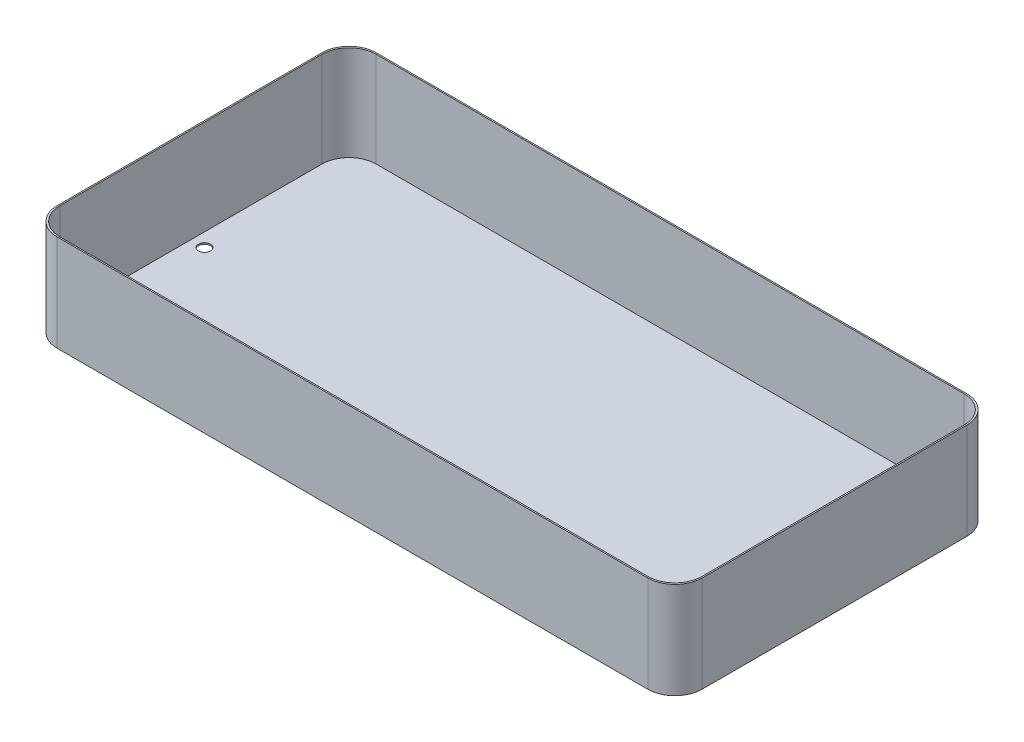
ISO-10303-21;
HEADER;
FILE_DESCRIPTION(('STEP AP214'),'2;1');
FILE_NAME('part.step','',(''),(''),'','','');
FILE_SCHEMA(('AUTOMOTIVE_DESIGN { 1 0 10303 214 1 1 1 1 }'));
ENDSEC;
DATA;
#1=APPLICATION_CONTEXT('core data for automotive mechanical design processes');
#2=APPLICATION_PROTOCOL_DEFINITION('international standard','automotive_design',2000,#1);
#3=PRODUCT_CONTEXT('',#1,'mechanical');
#4=PRODUCT('Part','Part','',(#3));
#5=PRODUCT_RELATED_PRODUCT_CATEGORY('part','',(#4));
#6=PRODUCT_DEFINITION_FORMATION('','',#4);
#7=PRODUCT_DEFINITION_CONTEXT('part definition',#1,'design');
#8=PRODUCT_DEFINITION('design','',#6,#7);
#9=PRODUCT_DEFINITION_SHAPE('','',#8);
#10=(LENGTH_UNIT() NAMED_UNIT(*) SI_UNIT(.MILLI.,.METRE.));
#11=(NAMED_UNIT(*) PLANE_ANGLE_UNIT() SI_UNIT($,.RADIAN.));
#12=(NAMED_UNIT(*) SI_UNIT($,.STERADIAN.) SOLID_ANGLE_UNIT());
#13=UNCERTAINTY_MEASURE_WITH_UNIT(LENGTH_MEASURE(1.E-05),#10,'distance_accuracy_value','');
#14=(GEOMETRIC_REPRESENTATION_CONTEXT(3) GLOBAL_UNCERTAINTY_ASSIGNED_CONTEXT((#13)) GLOBAL_UNIT_ASSIGNED_CONTEXT((#10,
#11,#12)) REPRESENTATION_CONTEXT('',''));
#15=CARTESIAN_POINT('',(0.,0.,0.));
#16=DIRECTION('',(0.,0.,1.));
#17=DIRECTION('',(1.,0.,0.));
#18=AXIS2_PLACEMENT_3D('',#15,#16,#17);
#19=CARTESIAN_POINT('',(0.,177.8,0.));
#20=DIRECTION('',(0.,-1.,0.));
#21=DIRECTION('',(0.,0.,-1.));
#22=AXIS2_PLACEMENT_3D('',#19,#20,#21);
#23=PLANE('',#22);
#24=DIRECTION('',(0.,0.,-1.));
#25=VECTOR('',#24,1.);
#26=CARTESIAN_POINT('',(603.25,177.8,298.45));
#27=LINE('',#26,#25);
#28=CARTESIAN_POINT('',(603.25,177.8,247.65));
#29=VERTEX_POINT('',#28);
#30=CARTESIAN_POINT('',(603.25,177.8,-247.65));
#31=VERTEX_POINT('',#30);
#32=EDGE_CURVE('E242',#29,#31,#27,.T.);
#33=ORIENTED_EDGE('',*,*,#32,.T.);
#34=CARTESIAN_POINT('',(552.45,177.8,-247.65));
#35=DIRECTION('',(0.,-1.,0.));
#36=DIRECTION('',(0.,0.,-1.));
#37=AXIS2_PLACEMENT_3D('',#34,#35,#36);
#38=CIRCLE('',#37,50.8);
#39=CARTESIAN_POINT('',(552.45,177.8,-298.45));
#40=VERTEX_POINT('',#39);
#41=EDGE_CURVE('E11',#31,#40,#38,.F.);
#42=ORIENTED_EDGE('',*,*,#41,.T.);
#43=DIRECTION('',(-1.,0.,0.));
#44=VECTOR('',#43,1.);
#45=CARTESIAN_POINT('',(-603.25,177.8,-298.45));
#46=LINE('',#45,#44);
#47=CARTESIAN_POINT('',(-552.45,177.8,-298.45));
#48=VERTEX_POINT('',#47);
#49=EDGE_CURVE('E253',#40,#48,#46,.T.);
#50=ORIENTED_EDGE('',*,*,#49,.T.);
#51=CARTESIAN_POINT('',(-552.45,177.8,-247.65));
#52=DIRECTION('',(0.,-1.,0.));
#53=DIRECTION('',(0.,0.,-1.));
#54=AXIS2_PLACEMENT_3D('',#51,#52,#53);
#55=CIRCLE('',#54,50.8);
#56=CARTESIAN_POINT('',(-603.25,177.8,-247.65));
#57=VERTEX_POINT('',#56);
#58=EDGE_CURVE('E58',#48,#57,#55,.F.);
#59=ORIENTED_EDGE('',*,*,#58,.T.);
#60=DIRECTION('',(0.,0.,1.));
#61=VECTOR('',#60,1.);
#62=CARTESIAN_POINT('',(-603.25,177.8,298.45));
#63=LINE('',#62,#61);
#64=CARTESIAN_POINT('',(-603.25,177.8,247.65));
#65=VERTEX_POINT('',#64);
#66=EDGE_CURVE('E181',#57,#65,#63,.T.);
#67=ORIENTED_EDGE('',*,*,#66,.T.);
#68=CARTESIAN_POINT('',(-552.45,177.8,247.65));
#69=DIRECTION('',(0.,-1.,0.));
#70=DIRECTION('',(0.,0.,-1.));
#71=AXIS2_PLACEMENT_3D('',#68,#69,#70);
#72=CIRCLE('',#71,50.8);
#73=CARTESIAN_POINT('',(-552.45,177.8,298.45));
#74=VERTEX_POINT('',#73);
#75=EDGE_CURVE('E237',#65,#74,#72,.F.);
#76=ORIENTED_EDGE('',*,*,#75,.T.);
#77=DIRECTION('',(1.,0.,0.));
#78=VECTOR('',#77,1.);
#79=CARTESIAN_POINT('',(-603.25,177.8,298.45));
#80=LINE('',#79,#78);
#81=CARTESIAN_POINT('',(552.45,177.8,298.45));
#82=VERTEX_POINT('',#81);
#83=EDGE_CURVE('E176',#74,#82,#80,.T.);
#84=ORIENTED_EDGE('',*,*,#83,.T.);
#85=CARTESIAN_POINT('',(552.45,177.8,247.65));
#86=DIRECTION('',(0.,-1.,0.));
#87=DIRECTION('',(0.,0.,-1.));
#88=AXIS2_PLACEMENT_3D('',#85,#86,#87);
#89=CIRCLE('',#88,50.8);
#90=EDGE_CURVE('E44',#82,#29,#89,.F.);
#91=ORIENTED_EDGE('',*,*,#90,.T.);
#92=EDGE_LOOP('',(#33,#42,#50,#59,#67,#76,#84,#91));
#93=FACE_BOUND('',#92,.T.);
#94=DIRECTION('',(0.,0.,-1.));
#95=VECTOR('',#94,1.);
#96=CARTESIAN_POINT('',(600.71,177.8,295.91));
#97=LINE('',#96,#95);
#98=CARTESIAN_POINT('',(600.71,177.8,245.11));
#99=VERTEX_POINT('',#98);
#100=CARTESIAN_POINT('',(600.71,177.8,-245.11));
#101=VERTEX_POINT('',#100);
#102=EDGE_CURVE('E171',#99,#101,#97,.T.);
#103=ORIENTED_EDGE('',*,*,#102,.F.);
#104=CARTESIAN_POINT('',(549.91,177.8,245.11));
#105=DIRECTION('',(0.,-1.,0.));
#106=DIRECTION('',(0.,0.,-1.));
#107=AXIS2_PLACEMENT_3D('',#104,#105,#106);
#108=CIRCLE('',#107,50.8);
#109=CARTESIAN_POINT('',(549.91,177.8,295.91));
#110=VERTEX_POINT('',#109);
#111=EDGE_CURVE('E229',#99,#110,#108,.T.);
#112=ORIENTED_EDGE('',*,*,#111,.T.);
#113=DIRECTION('',(1.,0.,0.));
#114=VECTOR('',#113,1.);
#115=CARTESIAN_POINT('',(-600.71,177.8,295.91));
#116=LINE('',#115,#114);
#117=CARTESIAN_POINT('',(-549.91,177.8,295.91));
#118=VERTEX_POINT('',#117);
#119=EDGE_CURVE('E254',#118,#110,#116,.T.);
#120=ORIENTED_EDGE('',*,*,#119,.F.);
#121=CARTESIAN_POINT('',(-549.91,177.8,245.11));
#122=DIRECTION('',(0.,-1.,0.));
#123=DIRECTION('',(0.,0.,-1.));
#124=AXIS2_PLACEMENT_3D('',#121,#122,#123);
#125=CIRCLE('',#124,50.8);
#126=CARTESIAN_POINT('',(-600.71,177.8,245.11));
#127=VERTEX_POINT('',#126);
#128=EDGE_CURVE('E175',#118,#127,#125,.T.);
#129=ORIENTED_EDGE('',*,*,#128,.T.);
#130=DIRECTION('',(0.,0.,1.));
#131=VECTOR('',#130,1.);
#132=CARTESIAN_POINT('',(-600.71,177.8,295.91));
#133=LINE('',#132,#131);
#134=CARTESIAN_POINT('',(-600.71,177.8,-245.11));
#135=VERTEX_POINT('',#134);
#136=EDGE_CURVE('E281',#135,#127,#133,.T.);
#137=ORIENTED_EDGE('',*,*,#136,.F.);
#138=CARTESIAN_POINT('',(-549.91,177.8,-245.11));
#139=DIRECTION('',(0.,-1.,0.));
#140=DIRECTION('',(0.,0.,-1.));
#141=AXIS2_PLACEMENT_3D('',#138,#139,#140);
#142=CIRCLE('',#141,50.8);
#143=CARTESIAN_POINT('',(-549.91,177.8,-295.91));
#144=VERTEX_POINT('',#143);
#145=EDGE_CURVE('E232',#135,#144,#142,.T.);
#146=ORIENTED_EDGE('',*,*,#145,.T.);
#147=DIRECTION('',(-1.,0.,0.));
#148=VECTOR('',#147,1.);
#149=CARTESIAN_POINT('',(-600.71,177.8,-295.91));
#150=LINE('',#149,#148);
#151=CARTESIAN_POINT('',(549.91,177.8,-295.91));
#152=VERTEX_POINT('',#151);
#153=EDGE_CURVE('E278',#152,#144,#150,.T.);
#154=ORIENTED_EDGE('',*,*,#153,.F.);
#155=CARTESIAN_POINT('',(549.91,177.8,-245.11));
#156=DIRECTION('',(0.,-1.,0.));
#157=DIRECTION('',(0.,0.,-1.));
#158=AXIS2_PLACEMENT_3D('',#155,#156,#157);
#159=CIRCLE('',#158,50.8);
#160=EDGE_CURVE('E234',#152,#101,#159,.T.);
#161=ORIENTED_EDGE('',*,*,#160,.T.);
#162=EDGE_LOOP('',(#103,#112,#120,#129,#137,#146,#154,#161));
#163=FACE_BOUND('',#162,.T.);
#164=ADVANCED_FACE('F36',(#93,#163),#23,.F.);
#165=CARTESIAN_POINT('',(603.25,177.8,298.45));
#166=DIRECTION('',(-1.,0.,0.));
#167=DIRECTION('',(0.,0.,1.));
#168=AXIS2_PLACEMENT_3D('',#165,#166,#167);
#169=PLANE('',#168);
#170=DIRECTION('',(0.,0.,1.));
#171=VECTOR('',#170,1.);
#172=CARTESIAN_POINT('',(603.25,-2.54,298.45));
#173=LINE('',#172,#171);
#174=CARTESIAN_POINT('',(603.25,-2.54,-247.65));
#175=VERTEX_POINT('',#174);
#176=CARTESIAN_POINT('',(603.25,-2.54,247.65));
#177=VERTEX_POINT('',#176);
#178=EDGE_CURVE('E263',#175,#177,#173,.T.);
#179=ORIENTED_EDGE('',*,*,#178,.F.);
#180=DIRECTION('',(0.,-1.,0.));
#181=VECTOR('',#180,1.);
#182=CARTESIAN_POINT('',(603.25,177.8,-247.65));
#183=LINE('',#182,#181);
#184=EDGE_CURVE('E218',#175,#31,#183,.F.);
#185=ORIENTED_EDGE('',*,*,#184,.T.);
#186=ORIENTED_EDGE('',*,*,#32,.F.);
#187=DIRECTION('',(0.,-1.,0.));
#188=VECTOR('',#187,1.);
#189=CARTESIAN_POINT('',(603.25,177.8,247.65));
#190=LINE('',#189,#188);
#191=EDGE_CURVE('E215',#29,#177,#190,.T.);
#192=ORIENTED_EDGE('',*,*,#191,.T.);
#193=EDGE_LOOP('',(#179,#185,#186,#192));
#194=FACE_BOUND('',#193,.T.);
#195=ADVANCED_FACE('F250',(#194),#169,.F.);
#196=CARTESIAN_POINT('',(-603.25,177.8,-298.45));
#197=DIRECTION('',(0.,0.,1.));
#198=DIRECTION('',(1.,0.,0.));
#199=AXIS2_PLACEMENT_3D('',#196,#197,#198);
#200=PLANE('',#199);
#201=ORIENTED_EDGE('',*,*,#49,.F.);
#202=DIRECTION('',(0.,-1.,0.));
#203=VECTOR('',#202,1.);
#204=CARTESIAN_POINT('',(552.45,177.8,-298.45));
#205=LINE('',#204,#203);
#206=CARTESIAN_POINT('',(552.45,-2.54,-298.45));
#207=VERTEX_POINT('',#206);
#208=EDGE_CURVE('E204',#40,#207,#205,.T.);
#209=ORIENTED_EDGE('',*,*,#208,.T.);
#210=DIRECTION('',(1.,0.,0.));
#211=VECTOR('',#210,1.);
#212=CARTESIAN_POINT('',(603.25,-2.54,-298.45));
#213=LINE('',#212,#211);
#214=CARTESIAN_POINT('',(-552.449999999999,-2.54,-298.45));
#215=VERTEX_POINT('',#214);
#216=EDGE_CURVE('E272',#215,#207,#213,.T.);
#217=ORIENTED_EDGE('',*,*,#216,.F.);
#218=DIRECTION('',(0.,-1.,0.));
#219=VECTOR('',#218,1.);
#220=CARTESIAN_POINT('',(-552.45,177.8,-298.45));
#221=LINE('',#220,#219);
#222=EDGE_CURVE('E202',#215,#48,#221,.F.);
#223=ORIENTED_EDGE('',*,*,#222,.T.);
#224=EDGE_LOOP('',(#201,#209,#217,#223));
#225=FACE_BOUND('',#224,.T.);
#226=ADVANCED_FACE('F335',(#225),#200,.F.);
#227=CARTESIAN_POINT('',(-603.25,177.8,298.45));
#228=DIRECTION('',(1.,0.,0.));
#229=DIRECTION('',(0.,0.,-1.));
#230=AXIS2_PLACEMENT_3D('',#227,#228,#229);
#231=PLANE('',#230);
#232=DIRECTION('',(0.,0.,-1.));
#233=VECTOR('',#232,1.);
#234=CARTESIAN_POINT('',(-603.25,-2.54,298.45));
#235=LINE('',#234,#233);
#236=CARTESIAN_POINT('',(-603.25,-2.54,247.65));
#237=VERTEX_POINT('',#236);
#238=CARTESIAN_POINT('',(-603.25,-2.54,-247.65));
#239=VERTEX_POINT('',#238);
#240=EDGE_CURVE('E293',#237,#239,#235,.T.);
#241=ORIENTED_EDGE('',*,*,#240,.F.);
#242=DIRECTION('',(0.,-1.,0.));
#243=VECTOR('',#242,1.);
#244=CARTESIAN_POINT('',(-603.25,177.8,247.65));
#245=LINE('',#244,#243);
#246=EDGE_CURVE('E51',#237,#65,#245,.F.);
#247=ORIENTED_EDGE('',*,*,#246,.T.);
#248=ORIENTED_EDGE('',*,*,#66,.F.);
#249=DIRECTION('',(0.,-1.,0.));
#250=VECTOR('',#249,1.);
#251=CARTESIAN_POINT('',(-603.25,177.8,-247.65));
#252=LINE('',#251,#250);
#253=EDGE_CURVE('E225',#57,#239,#252,.T.);
#254=ORIENTED_EDGE('',*,*,#253,.T.);
#255=EDGE_LOOP('',(#241,#247,#248,#254));
#256=FACE_BOUND('',#255,.T.);
#257=ADVANCED_FACE('F294',(#256),#231,.F.);
#258=CARTESIAN_POINT('',(-603.25,177.8,298.45));
#259=DIRECTION('',(0.,0.,-1.));
#260=DIRECTION('',(-1.,0.,0.));
#261=AXIS2_PLACEMENT_3D('',#258,#259,#260);
#262=PLANE('',#261);
#263=DIRECTION('',(-1.,0.,0.));
#264=VECTOR('',#263,1.);
#265=CARTESIAN_POINT('',(603.25,-2.54,298.45));
#266=LINE('',#265,#264);
#267=CARTESIAN_POINT('',(552.45,-2.54,298.45));
#268=VERTEX_POINT('',#267);
#269=CARTESIAN_POINT('',(-552.449999999999,-2.54,298.45));
#270=VERTEX_POINT('',#269);
#271=EDGE_CURVE('E262',#268,#270,#266,.T.);
#272=ORIENTED_EDGE('',*,*,#271,.F.);
#273=DIRECTION('',(0.,-1.,0.));
#274=VECTOR('',#273,1.);
#275=CARTESIAN_POINT('',(552.45,177.8,298.45));
#276=LINE('',#275,#274);
#277=EDGE_CURVE('E223',#268,#82,#276,.F.);
#278=ORIENTED_EDGE('',*,*,#277,.T.);
#279=ORIENTED_EDGE('',*,*,#83,.F.);
#280=DIRECTION('',(0.,-1.,0.));
#281=VECTOR('',#280,1.);
#282=CARTESIAN_POINT('',(-552.45,177.8,298.45));
#283=LINE('',#282,#281);
#284=EDGE_CURVE('E220',#74,#270,#283,.T.);
#285=ORIENTED_EDGE('',*,*,#284,.T.);
#286=EDGE_LOOP('',(#272,#278,#279,#285));
#287=FACE_BOUND('',#286,.T.);
#288=ADVANCED_FACE('F265',(#287),#262,.F.);
#289=CARTESIAN_POINT('',(600.71,177.8,295.91));
#290=DIRECTION('',(-1.,0.,0.));
#291=DIRECTION('',(0.,0.,1.));
#292=AXIS2_PLACEMENT_3D('',#289,#290,#291);
#293=PLANE('',#292);
#294=DIRECTION('',(0.,0.,-1.));
#295=VECTOR('',#294,1.);
#296=CARTESIAN_POINT('',(600.71,0.,295.91));
#297=LINE('',#296,#295);
#298=CARTESIAN_POINT('',(600.71,0.,245.11));
#299=VERTEX_POINT('',#298);
#300=CARTESIAN_POINT('',(600.71,0.,-245.11));
#301=VERTEX_POINT('',#300);
#302=EDGE_CURVE('E267',#299,#301,#297,.T.);
#303=ORIENTED_EDGE('',*,*,#302,.F.);
#304=DIRECTION('',(0.,-1.,0.));
#305=VECTOR('',#304,1.);
#306=CARTESIAN_POINT('',(600.71,177.8,245.11));
#307=LINE('',#306,#305);
#308=EDGE_CURVE('E191',#299,#99,#307,.F.);
#309=ORIENTED_EDGE('',*,*,#308,.T.);
#310=ORIENTED_EDGE('',*,*,#102,.T.);
#311=DIRECTION('',(0.,-1.,0.));
#312=VECTOR('',#311,1.);
#313=CARTESIAN_POINT('',(600.71,0.,-245.11));
#314=LINE('',#313,#312);
#315=EDGE_CURVE('E188',#101,#301,#314,.T.);
#316=ORIENTED_EDGE('',*,*,#315,.T.);
#317=EDGE_LOOP('',(#303,#309,#310,#316));
#318=FACE_BOUND('',#317,.T.);
#319=ADVANCED_FACE('F339',(#318),#293,.T.);
#320=CARTESIAN_POINT('',(-600.71,177.8,-295.91));
#321=DIRECTION('',(0.,0.,1.));
#322=DIRECTION('',(1.,0.,0.));
#323=AXIS2_PLACEMENT_3D('',#320,#321,#322);
#324=PLANE('',#323);
#325=ORIENTED_EDGE('',*,*,#153,.T.);
#326=DIRECTION('',(0.,-1.,0.));
#327=VECTOR('',#326,1.);
#328=CARTESIAN_POINT('',(-549.91,0.,-295.91));
#329=LINE('',#328,#327);
#330=CARTESIAN_POINT('',(-549.91,0.,-295.91));
#331=VERTEX_POINT('',#330);
#332=EDGE_CURVE('E199',#144,#331,#329,.T.);
#333=ORIENTED_EDGE('',*,*,#332,.T.);
#334=DIRECTION('',(-1.,0.,0.));
#335=VECTOR('',#334,1.);
#336=CARTESIAN_POINT('',(-600.71,0.,-295.91));
#337=LINE('',#336,#335);
#338=CARTESIAN_POINT('',(549.91,0.,-295.91));
#339=VERTEX_POINT('',#338);
#340=EDGE_CURVE('E270',#339,#331,#337,.T.);
#341=ORIENTED_EDGE('',*,*,#340,.F.);
#342=DIRECTION('',(0.,-1.,0.));
#343=VECTOR('',#342,1.);
#344=CARTESIAN_POINT('',(549.91,177.8,-295.91));
#345=LINE('',#344,#343);
#346=EDGE_CURVE('E197',#339,#152,#345,.F.);
#347=ORIENTED_EDGE('',*,*,#346,.T.);
#348=EDGE_LOOP('',(#325,#333,#341,#347));
#349=FACE_BOUND('',#348,.T.);
#350=ADVANCED_FACE('F424',(#349),#324,.T.);
#351=CARTESIAN_POINT('',(-600.71,177.8,295.91));
#352=DIRECTION('',(1.,0.,0.));
#353=DIRECTION('',(0.,0.,-1.));
#354=AXIS2_PLACEMENT_3D('',#351,#352,#353);
#355=PLANE('',#354);
#356=ORIENTED_EDGE('',*,*,#136,.T.);
#357=DIRECTION('',(0.,-1.,0.));
#358=VECTOR('',#357,1.);
#359=CARTESIAN_POINT('',(-600.71,0.,245.11));
#360=LINE('',#359,#358);
#361=CARTESIAN_POINT('',(-600.71,0.,245.11));
#362=VERTEX_POINT('',#361);
#363=EDGE_CURVE('E195',#127,#362,#360,.T.);
#364=ORIENTED_EDGE('',*,*,#363,.T.);
#365=DIRECTION('',(0.,0.,1.));
#366=VECTOR('',#365,1.);
#367=CARTESIAN_POINT('',(-600.71,0.,295.91));
#368=LINE('',#367,#366);
#369=CARTESIAN_POINT('',(-600.71,0.,-245.11));
#370=VERTEX_POINT('',#369);
#371=EDGE_CURVE('E155',#370,#362,#368,.T.);
#372=ORIENTED_EDGE('',*,*,#371,.F.);
#373=DIRECTION('',(0.,-1.,0.));
#374=VECTOR('',#373,1.);
#375=CARTESIAN_POINT('',(-600.71,177.8,-245.11));
#376=LINE('',#375,#374);
#377=EDGE_CURVE('E193',#370,#135,#376,.F.);
#378=ORIENTED_EDGE('',*,*,#377,.T.);
#379=EDGE_LOOP('',(#356,#364,#372,#378));
#380=FACE_BOUND('',#379,.T.);
#381=ADVANCED_FACE('F413',(#380),#355,.T.);
#382=CARTESIAN_POINT('',(-600.71,177.8,295.91));
#383=DIRECTION('',(0.,0.,-1.));
#384=DIRECTION('',(-1.,0.,0.));
#385=AXIS2_PLACEMENT_3D('',#382,#383,#384);
#386=PLANE('',#385);
#387=ORIENTED_EDGE('',*,*,#119,.T.);
#388=DIRECTION('',(0.,-1.,0.));
#389=VECTOR('',#388,1.);
#390=CARTESIAN_POINT('',(549.91,0.,295.91));
#391=LINE('',#390,#389);
#392=CARTESIAN_POINT('',(549.91,0.,295.91));
#393=VERTEX_POINT('',#392);
#394=EDGE_CURVE('E170',#110,#393,#391,.T.);
#395=ORIENTED_EDGE('',*,*,#394,.T.);
#396=DIRECTION('',(1.,0.,0.));
#397=VECTOR('',#396,1.);
#398=CARTESIAN_POINT('',(-600.71,0.,295.91));
#399=LINE('',#398,#397);
#400=CARTESIAN_POINT('',(-549.91,0.,295.91));
#401=VERTEX_POINT('',#400);
#402=EDGE_CURVE('E153',#401,#393,#399,.T.);
#403=ORIENTED_EDGE('',*,*,#402,.F.);
#404=DIRECTION('',(0.,-1.,0.));
#405=VECTOR('',#404,1.);
#406=CARTESIAN_POINT('',(-549.91,177.8,295.91));
#407=LINE('',#406,#405);
#408=EDGE_CURVE('E167',#401,#118,#407,.F.);
#409=ORIENTED_EDGE('',*,*,#408,.T.);
#410=EDGE_LOOP('',(#387,#395,#403,#409));
#411=FACE_BOUND('',#410,.T.);
#412=ADVANCED_FACE('F166',(#411),#386,.T.);
#413=CARTESIAN_POINT('',(0.,0.,0.));
#414=DIRECTION('',(0.,1.,0.));
#415=DIRECTION('',(0.,0.,1.));
#416=AXIS2_PLACEMENT_3D('',#413,#414,#415);
#417=PLANE('',#416);
#418=CARTESIAN_POINT('',(-575.31,0.,0.));
#419=DIRECTION('',(0.,1.,0.));
#420=DIRECTION('',(0.,0.,1.));
#421=AXIS2_PLACEMENT_3D('',#418,#419,#420);
#422=CIRCLE('',#421,11.1125);
#423=CARTESIAN_POINT('',(-575.31,0.,11.1125));
#424=VERTEX_POINT('',#423);
#425=EDGE_CURVE('E306',#424,#424,#422,.T.);
#426=ORIENTED_EDGE('',*,*,#425,.F.);
#427=EDGE_LOOP('',(#426));
#428=FACE_BOUND('',#427,.T.);
#429=CARTESIAN_POINT('',(575.31,0.,0.));
#430=DIRECTION('',(0.,1.,0.));
#431=DIRECTION('',(0.,0.,1.));
#432=AXIS2_PLACEMENT_3D('',#429,#430,#431);
#433=CIRCLE('',#432,11.1125);
#434=CARTESIAN_POINT('',(575.31,0.,11.1125));
#435=VERTEX_POINT('',#434);
#436=EDGE_CURVE('E298',#435,#435,#433,.T.);
#437=ORIENTED_EDGE('',*,*,#436,.F.);
#438=EDGE_LOOP('',(#437));
#439=FACE_BOUND('',#438,.T.);
#440=ORIENTED_EDGE('',*,*,#402,.T.);
#441=CARTESIAN_POINT('',(549.91,0.,245.11));
#442=DIRECTION('',(0.,1.,0.));
#443=DIRECTION('',(0.,0.,1.));
#444=AXIS2_PLACEMENT_3D('',#441,#442,#443);
#445=CIRCLE('',#444,50.8);
#446=EDGE_CURVE('E160',#393,#299,#445,.T.);
#447=ORIENTED_EDGE('',*,*,#446,.T.);
#448=ORIENTED_EDGE('',*,*,#302,.T.);
#449=CARTESIAN_POINT('',(549.91,0.,-245.11));
#450=DIRECTION('',(0.,1.,0.));
#451=DIRECTION('',(0.,0.,1.));
#452=AXIS2_PLACEMENT_3D('',#449,#450,#451);
#453=CIRCLE('',#452,50.8);
#454=EDGE_CURVE('E178',#301,#339,#453,.T.);
#455=ORIENTED_EDGE('',*,*,#454,.T.);
#456=ORIENTED_EDGE('',*,*,#340,.T.);
#457=CARTESIAN_POINT('',(-549.91,0.,-245.11));
#458=DIRECTION('',(0.,1.,0.));
#459=DIRECTION('',(0.,0.,1.));
#460=AXIS2_PLACEMENT_3D('',#457,#458,#459);
#461=CIRCLE('',#460,50.8);
#462=EDGE_CURVE('E161',#331,#370,#461,.T.);
#463=ORIENTED_EDGE('',*,*,#462,.T.);
#464=ORIENTED_EDGE('',*,*,#371,.T.);
#465=CARTESIAN_POINT('',(-549.91,0.,245.11));
#466=DIRECTION('',(0.,1.,0.));
#467=DIRECTION('',(0.,0.,1.));
#468=AXIS2_PLACEMENT_3D('',#465,#466,#467);
#469=CIRCLE('',#468,50.8);
#470=EDGE_CURVE('E150',#362,#401,#469,.T.);
#471=ORIENTED_EDGE('',*,*,#470,.T.);
#472=EDGE_LOOP('',(#440,#447,#448,#455,#456,#463,#464,#471));
#473=FACE_BOUND('',#472,.T.);
#474=ADVANCED_FACE('F152',(#428,#439,#473),#417,.T.);
#475=CARTESIAN_POINT('',(0.,-2.54,0.));
#476=DIRECTION('',(0.,1.,0.));
#477=DIRECTION('',(0.,0.,1.));
#478=AXIS2_PLACEMENT_3D('',#475,#476,#477);
#479=PLANE('',#478);
#480=CARTESIAN_POINT('',(-575.31,-2.54,0.));
#481=DIRECTION('',(0.,1.,0.));
#482=DIRECTION('',(0.,0.,1.));
#483=AXIS2_PLACEMENT_3D('',#480,#481,#482);
#484=CIRCLE('',#483,11.1125);
#485=CARTESIAN_POINT('',(-575.31,-2.54,11.1125));
#486=VERTEX_POINT('',#485);
#487=EDGE_CURVE('E303',#486,#486,#484,.T.);
#488=ORIENTED_EDGE('',*,*,#487,.T.);
#489=EDGE_LOOP('',(#488));
#490=FACE_BOUND('',#489,.T.);
#491=CARTESIAN_POINT('',(575.31,-2.54,0.));
#492=DIRECTION('',(0.,1.,0.));
#493=DIRECTION('',(0.,0.,1.));
#494=AXIS2_PLACEMENT_3D('',#491,#492,#493);
#495=CIRCLE('',#494,11.1125);
#496=CARTESIAN_POINT('',(575.31,-2.54,11.1125));
#497=VERTEX_POINT('',#496);
#498=EDGE_CURVE('E295',#497,#497,#495,.T.);
#499=ORIENTED_EDGE('',*,*,#498,.T.);
#500=EDGE_LOOP('',(#499));
#501=FACE_BOUND('',#500,.T.);
#502=ORIENTED_EDGE('',*,*,#216,.T.);
#503=CARTESIAN_POINT('',(552.45,-2.53999999999999,-247.65));
#504=DIRECTION('',(0.,1.,0.));
#505=DIRECTION('',(0.,0.,1.));
#506=AXIS2_PLACEMENT_3D('',#503,#504,#505);
#507=CIRCLE('',#506,50.8);
#508=EDGE_CURVE('E213',#207,#175,#507,.F.);
#509=ORIENTED_EDGE('',*,*,#508,.T.);
#510=ORIENTED_EDGE('',*,*,#178,.T.);
#511=CARTESIAN_POINT('',(552.45,-2.53999999999999,247.65));
#512=DIRECTION('',(0.,1.,0.));
#513=DIRECTION('',(0.,0.,1.));
#514=AXIS2_PLACEMENT_3D('',#511,#512,#513);
#515=CIRCLE('',#514,50.8);
#516=EDGE_CURVE('E211',#177,#268,#515,.F.);
#517=ORIENTED_EDGE('',*,*,#516,.T.);
#518=ORIENTED_EDGE('',*,*,#271,.T.);
#519=CARTESIAN_POINT('',(-552.45,-2.53999999999999,247.65));
#520=DIRECTION('',(0.,1.,0.));
#521=DIRECTION('',(0.,0.,1.));
#522=AXIS2_PLACEMENT_3D('',#519,#520,#521);
#523=CIRCLE('',#522,50.8);
#524=EDGE_CURVE('E209',#270,#237,#523,.F.);
#525=ORIENTED_EDGE('',*,*,#524,.T.);
#526=ORIENTED_EDGE('',*,*,#240,.T.);
#527=CARTESIAN_POINT('',(-552.45,-2.53999999999999,-247.65));
#528=DIRECTION('',(0.,1.,0.));
#529=DIRECTION('',(0.,0.,1.));
#530=AXIS2_PLACEMENT_3D('',#527,#528,#529);
#531=CIRCLE('',#530,50.8);
#532=EDGE_CURVE('E207',#239,#215,#531,.F.);
#533=ORIENTED_EDGE('',*,*,#532,.T.);
#534=EDGE_LOOP('',(#502,#509,#510,#517,#518,#525,#526,#533));
#535=FACE_BOUND('',#534,.T.);
#536=ADVANCED_FACE('F261',(#490,#501,#535),#479,.F.);
#537=CARTESIAN_POINT('',(549.91,177.8,245.11));
#538=DIRECTION('',(0.,1.,0.));
#539=DIRECTION('',(0.,0.,1.));
#540=AXIS2_PLACEMENT_3D('',#537,#538,#539);
#541=CYLINDRICAL_SURFACE('',#540,50.8);
#542=ORIENTED_EDGE('',*,*,#111,.F.);
#543=ORIENTED_EDGE('',*,*,#308,.F.);
#544=ORIENTED_EDGE('',*,*,#446,.F.);
#545=ORIENTED_EDGE('',*,*,#394,.F.);
#546=EDGE_LOOP('',(#542,#543,#544,#545));
#547=FACE_BOUND('',#546,.T.);
#548=ADVANCED_FACE('F348',(#547),#541,.F.);
#549=CARTESIAN_POINT('',(-549.91,177.8,245.11));
#550=DIRECTION('',(0.,1.,0.));
#551=DIRECTION('',(0.,0.,1.));
#552=AXIS2_PLACEMENT_3D('',#549,#550,#551);
#553=CYLINDRICAL_SURFACE('',#552,50.8);
#554=ORIENTED_EDGE('',*,*,#128,.F.);
#555=ORIENTED_EDGE('',*,*,#408,.F.);
#556=ORIENTED_EDGE('',*,*,#470,.F.);
#557=ORIENTED_EDGE('',*,*,#363,.F.);
#558=EDGE_LOOP('',(#554,#555,#556,#557));
#559=FACE_BOUND('',#558,.T.);
#560=ADVANCED_FACE('F174',(#559),#553,.F.);
#561=CARTESIAN_POINT('',(-549.91,177.8,-245.11));
#562=DIRECTION('',(0.,1.,0.));
#563=DIRECTION('',(0.,0.,1.));
#564=AXIS2_PLACEMENT_3D('',#561,#562,#563);
#565=CYLINDRICAL_SURFACE('',#564,50.8);
#566=ORIENTED_EDGE('',*,*,#145,.F.);
#567=ORIENTED_EDGE('',*,*,#377,.F.);
#568=ORIENTED_EDGE('',*,*,#462,.F.);
#569=ORIENTED_EDGE('',*,*,#332,.F.);
#570=EDGE_LOOP('',(#566,#567,#568,#569));
#571=FACE_BOUND('',#570,.T.);
#572=ADVANCED_FACE('F354',(#571),#565,.F.);
#573=CARTESIAN_POINT('',(549.91,177.8,-245.11));
#574=DIRECTION('',(0.,1.,0.));
#575=DIRECTION('',(0.,0.,1.));
#576=AXIS2_PLACEMENT_3D('',#573,#574,#575);
#577=CYLINDRICAL_SURFACE('',#576,50.8);
#578=ORIENTED_EDGE('',*,*,#160,.F.);
#579=ORIENTED_EDGE('',*,*,#346,.F.);
#580=ORIENTED_EDGE('',*,*,#454,.F.);
#581=ORIENTED_EDGE('',*,*,#315,.F.);
#582=EDGE_LOOP('',(#578,#579,#580,#581));
#583=FACE_BOUND('',#582,.T.);
#584=ADVANCED_FACE('F357',(#583),#577,.F.);
#585=CARTESIAN_POINT('',(552.45,177.8,-247.65));
#586=DIRECTION('',(0.,-1.,0.));
#587=DIRECTION('',(0.,0.,-1.));
#588=AXIS2_PLACEMENT_3D('',#585,#586,#587);
#589=CYLINDRICAL_SURFACE('',#588,50.8);
#590=ORIENTED_EDGE('',*,*,#41,.F.);
#591=ORIENTED_EDGE('',*,*,#184,.F.);
#592=ORIENTED_EDGE('',*,*,#508,.F.);
#593=ORIENTED_EDGE('',*,*,#208,.F.);
#594=EDGE_LOOP('',(#590,#591,#592,#593));
#595=FACE_BOUND('',#594,.T.);
#596=ADVANCED_FACE('F361',(#595),#589,.T.);
#597=CARTESIAN_POINT('',(552.45,177.8,247.65));
#598=DIRECTION('',(0.,-1.,0.));
#599=DIRECTION('',(0.,0.,-1.));
#600=AXIS2_PLACEMENT_3D('',#597,#598,#599);
#601=CYLINDRICAL_SURFACE('',#600,50.8);
#602=ORIENTED_EDGE('',*,*,#90,.F.);
#603=ORIENTED_EDGE('',*,*,#277,.F.);
#604=ORIENTED_EDGE('',*,*,#516,.F.);
#605=ORIENTED_EDGE('',*,*,#191,.F.);
#606=EDGE_LOOP('',(#602,#603,#604,#605));
#607=FACE_BOUND('',#606,.T.);
#608=ADVANCED_FACE('F256',(#607),#601,.T.);
#609=CARTESIAN_POINT('',(-552.45,177.8,247.65));
#610=DIRECTION('',(0.,-1.,0.));
#611=DIRECTION('',(0.,0.,-1.));
#612=AXIS2_PLACEMENT_3D('',#609,#610,#611);
#613=CYLINDRICAL_SURFACE('',#612,50.8);
#614=ORIENTED_EDGE('',*,*,#75,.F.);
#615=ORIENTED_EDGE('',*,*,#246,.F.);
#616=ORIENTED_EDGE('',*,*,#524,.F.);
#617=ORIENTED_EDGE('',*,*,#284,.F.);
#618=EDGE_LOOP('',(#614,#615,#616,#617));
#619=FACE_BOUND('',#618,.T.);
#620=ADVANCED_FACE('F291',(#619),#613,.T.);
#621=CARTESIAN_POINT('',(-552.45,177.8,-247.65));
#622=DIRECTION('',(0.,-1.,0.));
#623=DIRECTION('',(0.,0.,-1.));
#624=AXIS2_PLACEMENT_3D('',#621,#622,#623);
#625=CYLINDRICAL_SURFACE('',#624,50.8);
#626=ORIENTED_EDGE('',*,*,#58,.F.);
#627=ORIENTED_EDGE('',*,*,#222,.F.);
#628=ORIENTED_EDGE('',*,*,#532,.F.);
#629=ORIENTED_EDGE('',*,*,#253,.F.);
#630=EDGE_LOOP('',(#626,#627,#628,#629));
#631=FACE_BOUND('',#630,.T.);
#632=ADVANCED_FACE('F38',(#631),#625,.T.);
#633=CARTESIAN_POINT('',(575.31,0.,0.));
#634=DIRECTION('',(0.,1.,0.));
#635=DIRECTION('',(0.,0.,1.));
#636=AXIS2_PLACEMENT_3D('',#633,#634,#635);
#637=CYLINDRICAL_SURFACE('',#636,11.1125);
#638=ORIENTED_EDGE('',*,*,#498,.F.);
#639=EDGE_LOOP('',(#638));
#640=FACE_BOUND('',#639,.T.);
#641=ORIENTED_EDGE('',*,*,#436,.T.);
#642=EDGE_LOOP('',(#641));
#643=FACE_BOUND('',#642,.T.);
#644=ADVANCED_FACE('F317',(#640,#643),#637,.F.);
#645=CARTESIAN_POINT('',(-575.31,0.,0.));
#646=DIRECTION('',(0.,1.,0.));
#647=DIRECTION('',(0.,0.,1.));
#648=AXIS2_PLACEMENT_3D('',#645,#646,#647);
#649=CYLINDRICAL_SURFACE('',#648,11.1125);
#650=ORIENTED_EDGE('',*,*,#487,.F.);
#651=EDGE_LOOP('',(#650));
#652=FACE_BOUND('',#651,.T.);
#653=ORIENTED_EDGE('',*,*,#425,.T.);
#654=EDGE_LOOP('',(#653));
#655=FACE_BOUND('',#654,.T.);
#656=ADVANCED_FACE('F310',(#652,#655),#649,.F.);
#657=CLOSED_SHELL('',(#164,#195,#226,#257,#288,#319,#350,#381,#412,#474,#536,#548,#560,#572,
#584,#596,#608,#620,#632,#644,#656));
#658=MANIFOLD_SOLID_BREP('B2',#657);
#659=ADVANCED_BREP_SHAPE_REPRESENTATION('',(#18,#658),#14);
#660=SHAPE_DEFINITION_REPRESENTATION(#9,#659);
ENDSEC;
END-ISO-10303-21;
